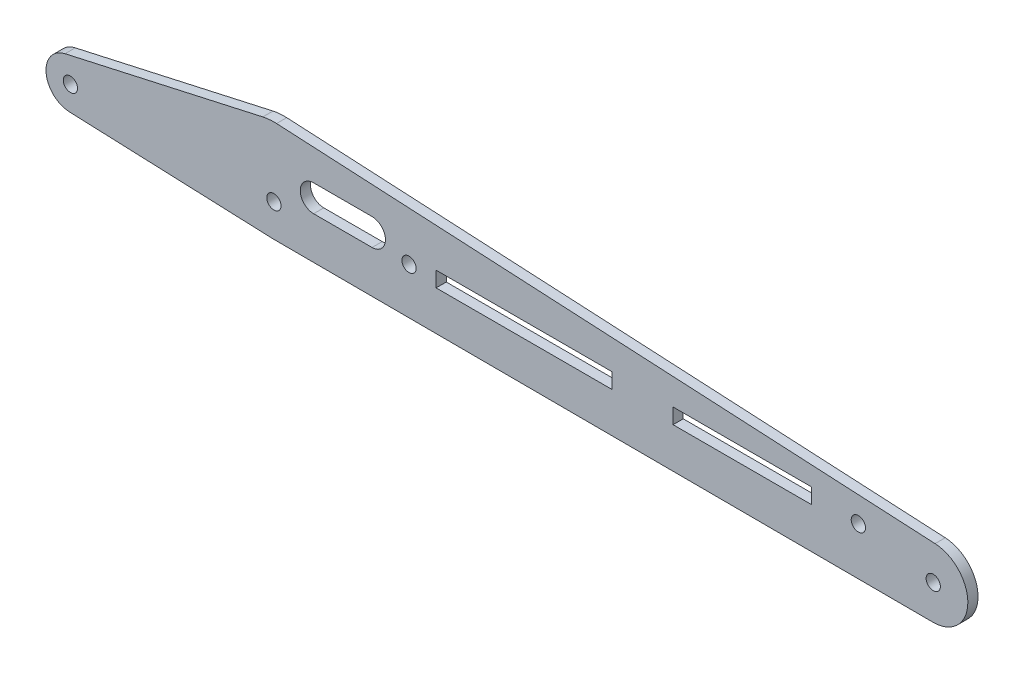
ISO-10303-21;
HEADER;
FILE_DESCRIPTION(('STEP AP214'),'2;1');
FILE_NAME('part.step','',(''),(''),'','','');
FILE_SCHEMA(('AUTOMOTIVE_DESIGN { 1 0 10303 214 1 1 1 1 }'));
ENDSEC;
DATA;
#1=APPLICATION_CONTEXT('core data for automotive mechanical design processes');
#2=APPLICATION_PROTOCOL_DEFINITION('international standard','automotive_design',2000,#1);
#3=PRODUCT_CONTEXT('',#1,'mechanical');
#4=PRODUCT('Part','Part','',(#3));
#5=PRODUCT_RELATED_PRODUCT_CATEGORY('part','',(#4));
#6=PRODUCT_DEFINITION_FORMATION('','',#4);
#7=PRODUCT_DEFINITION_CONTEXT('part definition',#1,'design');
#8=PRODUCT_DEFINITION('design','',#6,#7);
#9=PRODUCT_DEFINITION_SHAPE('','',#8);
#10=(LENGTH_UNIT() NAMED_UNIT(*) SI_UNIT(.MILLI.,.METRE.));
#11=(NAMED_UNIT(*) PLANE_ANGLE_UNIT() SI_UNIT($,.RADIAN.));
#12=(NAMED_UNIT(*) SI_UNIT($,.STERADIAN.) SOLID_ANGLE_UNIT());
#13=UNCERTAINTY_MEASURE_WITH_UNIT(LENGTH_MEASURE(1.E-05),#10,'distance_accuracy_value','');
#14=(GEOMETRIC_REPRESENTATION_CONTEXT(3) GLOBAL_UNCERTAINTY_ASSIGNED_CONTEXT((#13)) GLOBAL_UNIT_ASSIGNED_CONTEXT((#10,
#11,#12)) REPRESENTATION_CONTEXT('',''));
#15=CARTESIAN_POINT('',(0.,0.,0.));
#16=DIRECTION('',(0.,0.,1.));
#17=DIRECTION('',(1.,0.,0.));
#18=AXIS2_PLACEMENT_3D('',#15,#16,#17);
#19=CARTESIAN_POINT('',(1.0284513855781,19.5883770496251,2.5));
#20=DIRECTION('',(0.052430928939079,0.998624552917955,0.));
#21=DIRECTION('',(-0.998624552917955,0.052430928939079,0.));
#22=AXIS2_PLACEMENT_3D('',#19,#20,#21);
#23=PLANE('',#22);
#24=DIRECTION('',(0.998624552917955,-0.052430928939079,0.));
#25=VECTOR('',#24,1.);
#26=CARTESIAN_POINT('',(1.0284513855781,19.5883770496251,0.));
#27=LINE('',#26,#25);
#28=CARTESIAN_POINT('',(50.6553866117385,16.9828069114744,0.));
#29=VERTEX_POINT('',#28);
#30=CARTESIAN_POINT('',(212.445662895982,8.48830869980262,0.));
#31=VERTEX_POINT('',#30);
#32=EDGE_CURVE('E381',#29,#31,#27,.T.);
#33=ORIENTED_EDGE('',*,*,#32,.F.);
#34=DIRECTION('',(0.,0.,-1.));
#35=VECTOR('',#34,1.);
#36=CARTESIAN_POINT('',(50.6553866117385,16.9828069114744,2.5));
#37=LINE('',#36,#35);
#38=CARTESIAN_POINT('',(50.6553866117385,16.9828069114744,2.5));
#39=VERTEX_POINT('',#38);
#40=EDGE_CURVE('E12',#39,#29,#37,.T.);
#41=ORIENTED_EDGE('',*,*,#40,.F.);
#42=DIRECTION('',(0.998624552917955,-0.052430928939079,0.));
#43=VECTOR('',#42,1.);
#44=CARTESIAN_POINT('',(1.0284513855781,19.5883770496251,2.5));
#45=LINE('',#44,#43);
#46=CARTESIAN_POINT('',(212.445662895982,8.48830869980262,2.5));
#47=VERTEX_POINT('',#46);
#48=EDGE_CURVE('E339',#39,#47,#45,.T.);
#49=ORIENTED_EDGE('',*,*,#48,.T.);
#50=DIRECTION('',(0.,0.,-1.));
#51=VECTOR('',#50,1.);
#52=CARTESIAN_POINT('',(212.445662895982,8.48830869980262,2.5));
#53=LINE('',#52,#51);
#54=EDGE_CURVE('E369',#47,#31,#53,.T.);
#55=ORIENTED_EDGE('',*,*,#54,.T.);
#56=EDGE_LOOP('',(#33,#41,#49,#55));
#57=FACE_BOUND('',#56,.T.);
#58=ADVANCED_FACE('F47',(#57),#23,.T.);
#59=CARTESIAN_POINT('',(50.,4.5,2.5));
#60=DIRECTION('',(0.,0.,-1.));
#61=DIRECTION('',(-1.,0.,0.));
#62=AXIS2_PLACEMENT_3D('',#59,#60,#61);
#63=CYLINDRICAL_SURFACE('',#62,12.5);
#64=CARTESIAN_POINT('',(50.,4.5,0.));
#65=DIRECTION('',(0.,0.,1.));
#66=DIRECTION('',(1.,0.,0.));
#67=AXIS2_PLACEMENT_3D('',#64,#65,#66);
#68=CIRCLE('',#67,12.5);
#69=CARTESIAN_POINT('',(47.2770170996738,16.6998100036243,0.));
#70=VERTEX_POINT('',#69);
#71=EDGE_CURVE('E385',#29,#70,#68,.T.);
#72=ORIENTED_EDGE('',*,*,#71,.T.);
#73=DIRECTION('',(0.,0.,-1.));
#74=VECTOR('',#73,1.);
#75=CARTESIAN_POINT('',(47.2770170996738,16.6998100036243,2.5));
#76=LINE('',#75,#74);
#77=CARTESIAN_POINT('',(47.2770170996738,16.6998100036243,2.5));
#78=VERTEX_POINT('',#77);
#79=EDGE_CURVE('E56',#78,#70,#76,.T.);
#80=ORIENTED_EDGE('',*,*,#79,.F.);
#81=CARTESIAN_POINT('',(50.,4.5,2.5));
#82=DIRECTION('',(0.,0.,1.));
#83=DIRECTION('',(1.,0.,0.));
#84=AXIS2_PLACEMENT_3D('',#81,#82,#83);
#85=CIRCLE('',#84,12.5);
#86=EDGE_CURVE('E343',#39,#78,#85,.T.);
#87=ORIENTED_EDGE('',*,*,#86,.F.);
#88=ORIENTED_EDGE('',*,*,#40,.T.);
#89=EDGE_LOOP('',(#72,#80,#87,#88));
#90=FACE_BOUND('',#89,.T.);
#91=ADVANCED_FACE('F440',(#90),#63,.T.);
#92=CARTESIAN_POINT('',(-1.30703179215657,5.85590880173966,2.5));
#93=DIRECTION('',(0.217838632026095,-0.975984800289943,0.));
#94=DIRECTION('',(0.975984800289943,0.217838632026095,0.));
#95=AXIS2_PLACEMENT_3D('',#92,#93,#94);
#96=PLANE('',#95);
#97=DIRECTION('',(-0.975984800289943,-0.217838632026095,0.));
#98=VECTOR('',#97,1.);
#99=CARTESIAN_POINT('',(-1.30703179215657,5.85590880173966,0.));
#100=LINE('',#99,#98);
#101=CARTESIAN_POINT('',(-1.30703179215657,5.85590880173966,0.));
#102=VERTEX_POINT('',#101);
#103=EDGE_CURVE('E389',#70,#102,#100,.T.);
#104=ORIENTED_EDGE('',*,*,#103,.T.);
#105=DIRECTION('',(0.,0.,-1.));
#106=VECTOR('',#105,1.);
#107=CARTESIAN_POINT('',(-1.30703179215657,5.85590880173966,2.5));
#108=LINE('',#107,#106);
#109=CARTESIAN_POINT('',(-1.30703179215657,5.85590880173966,2.5));
#110=VERTEX_POINT('',#109);
#111=EDGE_CURVE('E428',#110,#102,#108,.T.);
#112=ORIENTED_EDGE('',*,*,#111,.F.);
#113=DIRECTION('',(-0.975984800289943,-0.217838632026095,0.));
#114=VECTOR('',#113,1.);
#115=CARTESIAN_POINT('',(-1.30703179215657,5.85590880173966,2.5));
#116=LINE('',#115,#114);
#117=EDGE_CURVE('E347',#78,#110,#116,.T.);
#118=ORIENTED_EDGE('',*,*,#117,.F.);
#119=ORIENTED_EDGE('',*,*,#79,.T.);
#120=EDGE_LOOP('',(#104,#112,#118,#119));
#121=FACE_BOUND('',#120,.T.);
#122=ADVANCED_FACE('F435',(#121),#96,.F.);
#123=CARTESIAN_POINT('',(0.,0.,2.5));
#124=DIRECTION('',(0.,0.,-1.));
#125=DIRECTION('',(-1.,0.,0.));
#126=AXIS2_PLACEMENT_3D('',#123,#124,#125);
#127=CYLINDRICAL_SURFACE('',#126,6.);
#128=CARTESIAN_POINT('',(0.,0.,0.));
#129=DIRECTION('',(0.,0.,1.));
#130=DIRECTION('',(1.,0.,0.));
#131=AXIS2_PLACEMENT_3D('',#128,#129,#130);
#132=CIRCLE('',#131,6.);
#133=CARTESIAN_POINT('',(-0.240433737056803,-5.99518069936886,0.));
#134=VERTEX_POINT('',#133);
#135=EDGE_CURVE('E393',#102,#134,#132,.T.);
#136=ORIENTED_EDGE('',*,*,#135,.T.);
#137=DIRECTION('',(0.,0.,-1.));
#138=VECTOR('',#137,1.);
#139=CARTESIAN_POINT('',(-0.240433737056803,-5.99518069936886,2.5));
#140=LINE('',#139,#138);
#141=CARTESIAN_POINT('',(-0.240433737056803,-5.99518069936886,2.5));
#142=VERTEX_POINT('',#141);
#143=EDGE_CURVE('E424',#142,#134,#140,.T.);
#144=ORIENTED_EDGE('',*,*,#143,.F.);
#145=CARTESIAN_POINT('',(0.,0.,2.5));
#146=DIRECTION('',(0.,0.,1.));
#147=DIRECTION('',(1.,0.,0.));
#148=AXIS2_PLACEMENT_3D('',#145,#146,#147);
#149=CIRCLE('',#148,6.);
#150=EDGE_CURVE('E351',#110,#142,#149,.T.);
#151=ORIENTED_EDGE('',*,*,#150,.F.);
#152=ORIENTED_EDGE('',*,*,#111,.T.);
#153=EDGE_LOOP('',(#136,#144,#151,#152));
#154=FACE_BOUND('',#153,.T.);
#155=ADVANCED_FACE('F462',(#154),#127,.T.);
#156=CARTESIAN_POINT('',(-0.240433737056803,-5.99518069936886,2.5));
#157=DIRECTION('',(0.0400722895094671,0.999196783228143,0.));
#158=DIRECTION('',(-0.999196783228143,0.0400722895094671,0.));
#159=AXIS2_PLACEMENT_3D('',#156,#157,#158);
#160=PLANE('',#159);
#161=DIRECTION('',(0.999196783228144,-0.0400722895094671,0.));
#162=VECTOR('',#161,1.);
#163=CARTESIAN_POINT('',(-0.240433737056803,-5.99518069936886,0.));
#164=LINE('',#163,#162);
#165=CARTESIAN_POINT('',(49.4990963811317,-7.9899597903518,0.));
#166=VERTEX_POINT('',#165);
#167=EDGE_CURVE('E397',#134,#166,#164,.T.);
#168=ORIENTED_EDGE('',*,*,#167,.T.);
#169=DIRECTION('',(0.,0.,-1.));
#170=VECTOR('',#169,1.);
#171=CARTESIAN_POINT('',(49.4990963811317,-7.9899597903518,2.5));
#172=LINE('',#171,#170);
#173=CARTESIAN_POINT('',(49.4990963811317,-7.9899597903518,2.5));
#174=VERTEX_POINT('',#173);
#175=EDGE_CURVE('E420',#174,#166,#172,.T.);
#176=ORIENTED_EDGE('',*,*,#175,.F.);
#177=DIRECTION('',(0.999196783228144,-0.0400722895094671,0.));
#178=VECTOR('',#177,1.);
#179=CARTESIAN_POINT('',(-0.240433737056803,-5.99518069936886,2.5));
#180=LINE('',#179,#178);
#181=EDGE_CURVE('E355',#142,#174,#180,.T.);
#182=ORIENTED_EDGE('',*,*,#181,.F.);
#183=ORIENTED_EDGE('',*,*,#143,.T.);
#184=EDGE_LOOP('',(#168,#176,#182,#183));
#185=FACE_BOUND('',#184,.T.);
#186=ADVANCED_FACE('F460',(#185),#160,.F.);
#187=CARTESIAN_POINT('',(50.,4.5,2.5));
#188=DIRECTION('',(0.,0.,-1.));
#189=DIRECTION('',(-1.,0.,0.));
#190=AXIS2_PLACEMENT_3D('',#187,#188,#189);
#191=CYLINDRICAL_SURFACE('',#190,12.5);
#192=CARTESIAN_POINT('',(50.,4.5,0.));
#193=DIRECTION('',(0.,0.,1.));
#194=DIRECTION('',(1.,0.,0.));
#195=AXIS2_PLACEMENT_3D('',#192,#193,#194);
#196=CIRCLE('',#195,12.5);
#197=CARTESIAN_POINT('',(49.9614214067658,-7.999940467544,0.));
#198=VERTEX_POINT('',#197);
#199=EDGE_CURVE('E401',#166,#198,#196,.T.);
#200=ORIENTED_EDGE('',*,*,#199,.T.);
#201=DIRECTION('',(0.,0.,-1.));
#202=VECTOR('',#201,1.);
#203=CARTESIAN_POINT('',(49.9614214067658,-7.999940467544,2.5));
#204=LINE('',#203,#202);
#205=CARTESIAN_POINT('',(49.9614214067658,-7.999940467544,2.5));
#206=VERTEX_POINT('',#205);
#207=EDGE_CURVE('E417',#206,#198,#204,.T.);
#208=ORIENTED_EDGE('',*,*,#207,.F.);
#209=CARTESIAN_POINT('',(50.,4.5,2.5));
#210=DIRECTION('',(0.,0.,1.));
#211=DIRECTION('',(1.,0.,0.));
#212=AXIS2_PLACEMENT_3D('',#209,#210,#211);
#213=CIRCLE('',#212,12.5);
#214=EDGE_CURVE('E359',#174,#206,#213,.T.);
#215=ORIENTED_EDGE('',*,*,#214,.F.);
#216=ORIENTED_EDGE('',*,*,#175,.T.);
#217=EDGE_LOOP('',(#200,#208,#215,#216));
#218=FACE_BOUND('',#217,.T.);
#219=ADVANCED_FACE('F456',(#218),#191,.T.);
#220=CARTESIAN_POINT('',(-0.0242141073003574,-7.84566969281035,2.5));
#221=DIRECTION('',(-0.00308628745873976,-0.99999523740352,0.));
#222=DIRECTION('',(0.99999523740352,-0.00308628745873976,0.));
#223=AXIS2_PLACEMENT_3D('',#220,#221,#222);
#224=PLANE('',#223);
#225=DIRECTION('',(-0.99999523740352,0.00308628745873976,0.));
#226=VECTOR('',#225,1.);
#227=CARTESIAN_POINT('',(-0.0242141073003574,-7.84566969281035,0.));
#228=LINE('',#227,#226);
#229=CARTESIAN_POINT('',(211.973766556601,-8.49995951792992,0.));
#230=VERTEX_POINT('',#229);
#231=EDGE_CURVE('E405',#230,#198,#228,.T.);
#232=ORIENTED_EDGE('',*,*,#231,.F.);
#233=DIRECTION('',(0.,0.,-1.));
#234=VECTOR('',#233,1.);
#235=CARTESIAN_POINT('',(211.973766556601,-8.49995951792992,2.5));
#236=LINE('',#235,#234);
#237=CARTESIAN_POINT('',(211.973766556601,-8.49995951792992,2.5));
#238=VERTEX_POINT('',#237);
#239=EDGE_CURVE('E414',#238,#230,#236,.T.);
#240=ORIENTED_EDGE('',*,*,#239,.F.);
#241=DIRECTION('',(-0.99999523740352,0.00308628745873976,0.));
#242=VECTOR('',#241,1.);
#243=CARTESIAN_POINT('',(-0.0242141073003574,-7.84566969281035,2.5));
#244=LINE('',#243,#242);
#245=EDGE_CURVE('E362',#238,#206,#244,.T.);
#246=ORIENTED_EDGE('',*,*,#245,.T.);
#247=ORIENTED_EDGE('',*,*,#207,.T.);
#248=EDGE_LOOP('',(#232,#240,#246,#247));
#249=FACE_BOUND('',#248,.T.);
#250=ADVANCED_FACE('F452',(#249),#224,.T.);
#251=CARTESIAN_POINT('',(212.,0.,2.5));
#252=DIRECTION('',(0.,0.,-1.));
#253=DIRECTION('',(-1.,0.,0.));
#254=AXIS2_PLACEMENT_3D('',#251,#252,#253);
#255=CYLINDRICAL_SURFACE('',#254,1.75000000000001);
#256=CARTESIAN_POINT('',(212.,0.,2.5));
#257=DIRECTION('',(0.,0.,1.));
#258=DIRECTION('',(1.,0.,0.));
#259=AXIS2_PLACEMENT_3D('',#256,#257,#258);
#260=CIRCLE('',#259,1.75000000000001);
#261=CARTESIAN_POINT('',(213.75,0.,2.5));
#262=VERTEX_POINT('',#261);
#263=EDGE_CURVE('E335',#262,#262,#260,.T.);
#264=ORIENTED_EDGE('',*,*,#263,.T.);
#265=EDGE_LOOP('',(#264));
#266=FACE_BOUND('',#265,.T.);
#267=CARTESIAN_POINT('',(212.,0.,0.));
#268=DIRECTION('',(0.,0.,1.));
#269=DIRECTION('',(1.,0.,0.));
#270=AXIS2_PLACEMENT_3D('',#267,#268,#269);
#271=CIRCLE('',#270,1.75000000000001);
#272=CARTESIAN_POINT('',(213.75,0.,0.));
#273=VERTEX_POINT('',#272);
#274=EDGE_CURVE('E377',#273,#273,#271,.T.);
#275=ORIENTED_EDGE('',*,*,#274,.F.);
#276=EDGE_LOOP('',(#275));
#277=FACE_BOUND('',#276,.T.);
#278=ADVANCED_FACE('F488',(#266,#277),#255,.F.);
#279=CARTESIAN_POINT('',(50.,0.,2.5));
#280=DIRECTION('',(0.,0.,-1.));
#281=DIRECTION('',(-1.,0.,0.));
#282=AXIS2_PLACEMENT_3D('',#279,#280,#281);
#283=CYLINDRICAL_SURFACE('',#282,1.75);
#284=CARTESIAN_POINT('',(50.,0.,2.5));
#285=DIRECTION('',(0.,0.,1.));
#286=DIRECTION('',(1.,0.,0.));
#287=AXIS2_PLACEMENT_3D('',#284,#285,#286);
#288=CIRCLE('',#287,1.75);
#289=CARTESIAN_POINT('',(51.75,0.,2.5));
#290=VERTEX_POINT('',#289);
#291=EDGE_CURVE('E330',#290,#290,#288,.T.);
#292=ORIENTED_EDGE('',*,*,#291,.T.);
#293=EDGE_LOOP('',(#292));
#294=FACE_BOUND('',#293,.T.);
#295=CARTESIAN_POINT('',(50.,0.,0.));
#296=DIRECTION('',(0.,0.,1.));
#297=DIRECTION('',(1.,0.,0.));
#298=AXIS2_PLACEMENT_3D('',#295,#296,#297);
#299=CIRCLE('',#298,1.75);
#300=CARTESIAN_POINT('',(51.75,0.,0.));
#301=VERTEX_POINT('',#300);
#302=EDGE_CURVE('E373',#301,#301,#299,.T.);
#303=ORIENTED_EDGE('',*,*,#302,.F.);
#304=EDGE_LOOP('',(#303));
#305=FACE_BOUND('',#304,.T.);
#306=ADVANCED_FACE('F490',(#294,#305),#283,.F.);
#307=CARTESIAN_POINT('',(0.,0.,2.5));
#308=DIRECTION('',(0.,0.,-1.));
#309=DIRECTION('',(-1.,0.,0.));
#310=AXIS2_PLACEMENT_3D('',#307,#308,#309);
#311=CYLINDRICAL_SURFACE('',#310,1.75);
#312=CARTESIAN_POINT('',(0.,0.,2.5));
#313=DIRECTION('',(0.,0.,1.));
#314=DIRECTION('',(1.,0.,0.));
#315=AXIS2_PLACEMENT_3D('',#312,#313,#314);
#316=CIRCLE('',#315,1.75);
#317=CARTESIAN_POINT('',(1.75,0.,2.5));
#318=VERTEX_POINT('',#317);
#319=EDGE_CURVE('E326',#318,#318,#316,.T.);
#320=ORIENTED_EDGE('',*,*,#319,.T.);
#321=EDGE_LOOP('',(#320));
#322=FACE_BOUND('',#321,.T.);
#323=CARTESIAN_POINT('',(0.,0.,0.));
#324=DIRECTION('',(0.,0.,1.));
#325=DIRECTION('',(1.,0.,0.));
#326=AXIS2_PLACEMENT_3D('',#323,#324,#325);
#327=CIRCLE('',#326,1.75);
#328=CARTESIAN_POINT('',(1.75,0.,0.));
#329=VERTEX_POINT('',#328);
#330=EDGE_CURVE('E234',#329,#329,#327,.T.);
#331=ORIENTED_EDGE('',*,*,#330,.F.);
#332=EDGE_LOOP('',(#331));
#333=FACE_BOUND('',#332,.T.);
#334=ADVANCED_FACE('F49',(#322,#333),#311,.F.);
#335=CARTESIAN_POINT('',(212.,0.,2.5));
#336=DIRECTION('',(0.,0.,-1.));
#337=DIRECTION('',(-1.,0.,0.));
#338=AXIS2_PLACEMENT_3D('',#335,#336,#337);
#339=CYLINDRICAL_SURFACE('',#338,8.5);
#340=CARTESIAN_POINT('',(212.,0.,0.));
#341=DIRECTION('',(0.,0.,1.));
#342=DIRECTION('',(1.,0.,0.));
#343=AXIS2_PLACEMENT_3D('',#340,#341,#342);
#344=CIRCLE('',#343,8.5);
#345=EDGE_CURVE('E331',#230,#31,#344,.T.);
#346=ORIENTED_EDGE('',*,*,#345,.T.);
#347=ORIENTED_EDGE('',*,*,#54,.F.);
#348=CARTESIAN_POINT('',(212.,0.,2.5));
#349=DIRECTION('',(0.,0.,1.));
#350=DIRECTION('',(1.,0.,0.));
#351=AXIS2_PLACEMENT_3D('',#348,#349,#350);
#352=CIRCLE('',#351,8.5);
#353=EDGE_CURVE('E366',#238,#47,#352,.T.);
#354=ORIENTED_EDGE('',*,*,#353,.F.);
#355=ORIENTED_EDGE('',*,*,#239,.T.);
#356=EDGE_LOOP('',(#346,#347,#354,#355));
#357=FACE_BOUND('',#356,.T.);
#358=ADVANCED_FACE('F449',(#357),#339,.T.);
#359=CARTESIAN_POINT('',(0.,0.,2.5));
#360=DIRECTION('',(0.,0.,1.));
#361=DIRECTION('',(1.,0.,0.));
#362=AXIS2_PLACEMENT_3D('',#359,#360,#361);
#363=PLANE('',#362);
#364=CARTESIAN_POINT('',(193.595777353465,3.28702322475749,2.5));
#365=DIRECTION('',(0.,0.,1.));
#366=DIRECTION('',(1.,0.,0.));
#367=AXIS2_PLACEMENT_3D('',#364,#365,#366);
#368=CIRCLE('',#367,1.75000000000001);
#369=CARTESIAN_POINT('',(195.345777353465,3.28702322475749,2.5));
#370=VERTEX_POINT('',#369);
#371=EDGE_CURVE('E670',#370,#370,#368,.T.);
#372=ORIENTED_EDGE('',*,*,#371,.F.);
#373=EDGE_LOOP('',(#372));
#374=FACE_BOUND('',#373,.T.);
#375=CARTESIAN_POINT('',(83.1882766397634,3.28702322475749,2.5));
#376=DIRECTION('',(0.,0.,1.));
#377=DIRECTION('',(1.,0.,0.));
#378=AXIS2_PLACEMENT_3D('',#375,#376,#377);
#379=CIRCLE('',#378,1.75);
#380=CARTESIAN_POINT('',(84.9382766397634,3.28702322475749,2.5));
#381=VERTEX_POINT('',#380);
#382=EDGE_CURVE('E672',#381,#381,#379,.T.);
#383=ORIENTED_EDGE('',*,*,#382,.F.);
#384=EDGE_LOOP('',(#383));
#385=FACE_BOUND('',#384,.T.);
#386=CARTESIAN_POINT('',(59.7582362209733,5.62656902603168,2.5));
#387=DIRECTION('',(0.,0.,1.));
#388=DIRECTION('',(1.,0.,0.));
#389=AXIS2_PLACEMENT_3D('',#386,#387,#388);
#390=CIRCLE('',#389,3.28795015374843);
#391=CARTESIAN_POINT('',(59.7582362209733,8.91451917978011,2.5));
#392=VERTEX_POINT('',#391);
#393=CARTESIAN_POINT('',(59.7582362209733,2.33861887228325,2.5));
#394=VERTEX_POINT('',#393);
#395=EDGE_CURVE('E63',#392,#394,#390,.T.);
#396=ORIENTED_EDGE('',*,*,#395,.F.);
#397=DIRECTION('',(-1.,0.,0.));
#398=VECTOR('',#397,1.);
#399=CARTESIAN_POINT('',(59.7582362209733,8.91451917978011,2.5));
#400=LINE('',#399,#398);
#401=CARTESIAN_POINT('',(74.1156185590081,8.91451917978011,2.5));
#402=VERTEX_POINT('',#401);
#403=EDGE_CURVE('E208',#402,#392,#400,.T.);
#404=ORIENTED_EDGE('',*,*,#403,.F.);
#405=CARTESIAN_POINT('',(74.1156185590081,5.62656902603168,2.5));
#406=DIRECTION('',(0.,0.,1.));
#407=DIRECTION('',(1.,0.,0.));
#408=AXIS2_PLACEMENT_3D('',#405,#406,#407);
#409=CIRCLE('',#408,3.28795015374843);
#410=CARTESIAN_POINT('',(74.1156185590081,2.33861887228325,2.5));
#411=VERTEX_POINT('',#410);
#412=EDGE_CURVE('E212',#411,#402,#409,.T.);
#413=ORIENTED_EDGE('',*,*,#412,.F.);
#414=DIRECTION('',(1.,0.,0.));
#415=VECTOR('',#414,1.);
#416=CARTESIAN_POINT('',(59.7582362209733,2.33861887228325,2.5));
#417=LINE('',#416,#415);
#418=EDGE_CURVE('E224',#394,#411,#417,.T.);
#419=ORIENTED_EDGE('',*,*,#418,.F.);
#420=EDGE_LOOP('',(#396,#404,#413,#419));
#421=FACE_BOUND('',#420,.T.);
#422=DIRECTION('',(0.,1.,0.));
#423=VECTOR('',#422,1.);
#424=CARTESIAN_POINT('',(133.027762357516,1.60489189527374,2.5));
#425=LINE('',#424,#423);
#426=CARTESIAN_POINT('',(133.027762357516,1.60489189527374,2.5));
#427=VERTEX_POINT('',#426);
#428=CARTESIAN_POINT('',(133.027762357516,5.37553065837328,2.5));
#429=VERTEX_POINT('',#428);
#430=EDGE_CURVE('E71',#427,#429,#425,.T.);
#431=ORIENTED_EDGE('',*,*,#430,.F.);
#432=DIRECTION('',(1.,0.,0.));
#433=VECTOR('',#432,1.);
#434=CARTESIAN_POINT('',(89.8528256396395,1.60489189527374,2.5));
#435=LINE('',#434,#433);
#436=CARTESIAN_POINT('',(89.8528256396395,1.60489189527374,2.5));
#437=VERTEX_POINT('',#436);
#438=EDGE_CURVE('E245',#437,#427,#435,.T.);
#439=ORIENTED_EDGE('',*,*,#438,.F.);
#440=DIRECTION('',(0.,-1.,0.));
#441=VECTOR('',#440,1.);
#442=CARTESIAN_POINT('',(89.8528256396395,1.60489189527374,2.5));
#443=LINE('',#442,#441);
#444=CARTESIAN_POINT('',(89.8528256396395,5.37553065837328,2.5));
#445=VERTEX_POINT('',#444);
#446=EDGE_CURVE('E265',#445,#437,#443,.T.);
#447=ORIENTED_EDGE('',*,*,#446,.F.);
#448=DIRECTION('',(-1.,0.,0.));
#449=VECTOR('',#448,1.);
#450=CARTESIAN_POINT('',(89.8528256396395,5.37553065837328,2.5));
#451=LINE('',#450,#449);
#452=EDGE_CURVE('E260',#429,#445,#451,.T.);
#453=ORIENTED_EDGE('',*,*,#452,.F.);
#454=EDGE_LOOP('',(#431,#439,#447,#453));
#455=FACE_BOUND('',#454,.T.);
#456=DIRECTION('',(0.,1.,0.));
#457=VECTOR('',#456,1.);
#458=CARTESIAN_POINT('',(182.086500773043,1.60489189527374,2.5));
#459=LINE('',#458,#457);
#460=CARTESIAN_POINT('',(182.086500773043,1.60489189527374,2.5));
#461=VERTEX_POINT('',#460);
#462=CARTESIAN_POINT('',(182.086500773043,5.37553065837328,2.5));
#463=VERTEX_POINT('',#462);
#464=EDGE_CURVE('E300',#461,#463,#459,.T.);
#465=ORIENTED_EDGE('',*,*,#464,.F.);
#466=DIRECTION('',(1.,0.,0.));
#467=VECTOR('',#466,1.);
#468=CARTESIAN_POINT('',(148.071936645753,1.60489189527374,2.5));
#469=LINE('',#468,#467);
#470=CARTESIAN_POINT('',(148.071936645753,1.60489189527374,2.5));
#471=VERTEX_POINT('',#470);
#472=EDGE_CURVE('E287',#471,#461,#469,.T.);
#473=ORIENTED_EDGE('',*,*,#472,.F.);
#474=DIRECTION('',(0.,-1.,0.));
#475=VECTOR('',#474,1.);
#476=CARTESIAN_POINT('',(148.071936645753,1.60489189527374,2.5));
#477=LINE('',#476,#475);
#478=CARTESIAN_POINT('',(148.071936645753,5.37553065837328,2.5));
#479=VERTEX_POINT('',#478);
#480=EDGE_CURVE('E308',#479,#471,#477,.T.);
#481=ORIENTED_EDGE('',*,*,#480,.F.);
#482=DIRECTION('',(-1.,0.,0.));
#483=VECTOR('',#482,1.);
#484=CARTESIAN_POINT('',(148.071936645753,5.37553065837328,2.5));
#485=LINE('',#484,#483);
#486=EDGE_CURVE('E303',#463,#479,#485,.T.);
#487=ORIENTED_EDGE('',*,*,#486,.F.);
#488=EDGE_LOOP('',(#465,#473,#481,#487));
#489=FACE_BOUND('',#488,.T.);
#490=ORIENTED_EDGE('',*,*,#319,.F.);
#491=EDGE_LOOP('',(#490));
#492=FACE_BOUND('',#491,.T.);
#493=ORIENTED_EDGE('',*,*,#291,.F.);
#494=EDGE_LOOP('',(#493));
#495=FACE_BOUND('',#494,.T.);
#496=ORIENTED_EDGE('',*,*,#263,.F.);
#497=EDGE_LOOP('',(#496));
#498=FACE_BOUND('',#497,.T.);
#499=ORIENTED_EDGE('',*,*,#48,.F.);
#500=ORIENTED_EDGE('',*,*,#86,.T.);
#501=ORIENTED_EDGE('',*,*,#117,.T.);
#502=ORIENTED_EDGE('',*,*,#150,.T.);
#503=ORIENTED_EDGE('',*,*,#181,.T.);
#504=ORIENTED_EDGE('',*,*,#214,.T.);
#505=ORIENTED_EDGE('',*,*,#245,.F.);
#506=ORIENTED_EDGE('',*,*,#353,.T.);
#507=EDGE_LOOP('',(#499,#500,#501,#502,#503,#504,#505,#506));
#508=FACE_BOUND('',#507,.T.);
#509=ADVANCED_FACE('F464',(#374,#385,#421,#455,#489,#492,#495,#498,#508),#363,.T.);
#510=CARTESIAN_POINT('',(0.,0.,0.));
#511=DIRECTION('',(0.,0.,1.));
#512=DIRECTION('',(1.,0.,0.));
#513=AXIS2_PLACEMENT_3D('',#510,#511,#512);
#514=PLANE('',#513);
#515=CARTESIAN_POINT('',(193.595777353465,3.28702322475749,0.));
#516=DIRECTION('',(0.,0.,1.));
#517=DIRECTION('',(1.,0.,0.));
#518=AXIS2_PLACEMENT_3D('',#515,#516,#517);
#519=CIRCLE('',#518,1.75000000000001);
#520=CARTESIAN_POINT('',(195.345777353465,3.28702322475749,0.));
#521=VERTEX_POINT('',#520);
#522=EDGE_CURVE('E304',#521,#521,#519,.T.);
#523=ORIENTED_EDGE('',*,*,#522,.T.);
#524=EDGE_LOOP('',(#523));
#525=FACE_BOUND('',#524,.T.);
#526=CARTESIAN_POINT('',(83.1882766397634,3.28702322475749,0.));
#527=DIRECTION('',(0.,0.,1.));
#528=DIRECTION('',(1.,0.,0.));
#529=AXIS2_PLACEMENT_3D('',#526,#527,#528);
#530=CIRCLE('',#529,1.75);
#531=CARTESIAN_POINT('',(84.9382766397634,3.28702322475749,0.));
#532=VERTEX_POINT('',#531);
#533=EDGE_CURVE('E215',#532,#532,#530,.T.);
#534=ORIENTED_EDGE('',*,*,#533,.T.);
#535=EDGE_LOOP('',(#534));
#536=FACE_BOUND('',#535,.T.);
#537=DIRECTION('',(-1.,0.,0.));
#538=VECTOR('',#537,1.);
#539=CARTESIAN_POINT('',(59.7582362209733,8.91451917978011,0.));
#540=LINE('',#539,#538);
#541=CARTESIAN_POINT('',(74.1156185590081,8.91451917978011,0.));
#542=VERTEX_POINT('',#541);
#543=CARTESIAN_POINT('',(59.7582362209733,8.91451917978011,0.));
#544=VERTEX_POINT('',#543);
#545=EDGE_CURVE('E193',#542,#544,#540,.T.);
#546=ORIENTED_EDGE('',*,*,#545,.T.);
#547=CARTESIAN_POINT('',(59.7582362209733,5.62656902603168,0.));
#548=DIRECTION('',(0.,0.,1.));
#549=DIRECTION('',(1.,0.,0.));
#550=AXIS2_PLACEMENT_3D('',#547,#548,#549);
#551=CIRCLE('',#550,3.28795015374843);
#552=CARTESIAN_POINT('',(59.7582362209733,2.33861887228325,0.));
#553=VERTEX_POINT('',#552);
#554=EDGE_CURVE('E186',#544,#553,#551,.T.);
#555=ORIENTED_EDGE('',*,*,#554,.T.);
#556=DIRECTION('',(1.,0.,0.));
#557=VECTOR('',#556,1.);
#558=CARTESIAN_POINT('',(59.7582362209733,2.33861887228325,0.));
#559=LINE('',#558,#557);
#560=CARTESIAN_POINT('',(74.1156185590081,2.33861887228325,0.));
#561=VERTEX_POINT('',#560);
#562=EDGE_CURVE('E197',#553,#561,#559,.T.);
#563=ORIENTED_EDGE('',*,*,#562,.T.);
#564=CARTESIAN_POINT('',(74.1156185590081,5.62656902603168,0.));
#565=DIRECTION('',(0.,0.,1.));
#566=DIRECTION('',(1.,0.,0.));
#567=AXIS2_PLACEMENT_3D('',#564,#565,#566);
#568=CIRCLE('',#567,3.28795015374843);
#569=EDGE_CURVE('E202',#561,#542,#568,.T.);
#570=ORIENTED_EDGE('',*,*,#569,.T.);
#571=EDGE_LOOP('',(#546,#555,#563,#570));
#572=FACE_BOUND('',#571,.T.);
#573=DIRECTION('',(1.,0.,0.));
#574=VECTOR('',#573,1.);
#575=CARTESIAN_POINT('',(89.8528256396395,1.60489189527374,0.));
#576=LINE('',#575,#574);
#577=CARTESIAN_POINT('',(89.8528256396395,1.60489189527374,0.));
#578=VERTEX_POINT('',#577);
#579=CARTESIAN_POINT('',(133.027762357516,1.60489189527374,0.));
#580=VERTEX_POINT('',#579);
#581=EDGE_CURVE('E253',#578,#580,#576,.T.);
#582=ORIENTED_EDGE('',*,*,#581,.T.);
#583=DIRECTION('',(0.,1.,0.));
#584=VECTOR('',#583,1.);
#585=CARTESIAN_POINT('',(133.027762357516,1.60489189527374,0.));
#586=LINE('',#585,#584);
#587=CARTESIAN_POINT('',(133.027762357516,5.37553065837328,0.));
#588=VERTEX_POINT('',#587);
#589=EDGE_CURVE('E240',#580,#588,#586,.T.);
#590=ORIENTED_EDGE('',*,*,#589,.T.);
#591=DIRECTION('',(-1.,0.,0.));
#592=VECTOR('',#591,1.);
#593=CARTESIAN_POINT('',(89.8528256396395,5.37553065837328,0.));
#594=LINE('',#593,#592);
#595=CARTESIAN_POINT('',(89.8528256396395,5.37553065837328,0.));
#596=VERTEX_POINT('',#595);
#597=EDGE_CURVE('E244',#588,#596,#594,.T.);
#598=ORIENTED_EDGE('',*,*,#597,.T.);
#599=DIRECTION('',(0.,-1.,0.));
#600=VECTOR('',#599,1.);
#601=CARTESIAN_POINT('',(89.8528256396395,1.60489189527374,0.));
#602=LINE('',#601,#600);
#603=EDGE_CURVE('E249',#596,#578,#602,.T.);
#604=ORIENTED_EDGE('',*,*,#603,.T.);
#605=EDGE_LOOP('',(#582,#590,#598,#604));
#606=FACE_BOUND('',#605,.T.);
#607=DIRECTION('',(1.,0.,0.));
#608=VECTOR('',#607,1.);
#609=CARTESIAN_POINT('',(148.071936645753,1.60489189527374,0.));
#610=LINE('',#609,#608);
#611=CARTESIAN_POINT('',(148.071936645753,1.60489189527374,0.));
#612=VERTEX_POINT('',#611);
#613=CARTESIAN_POINT('',(182.086500773043,1.60489189527374,0.));
#614=VERTEX_POINT('',#613);
#615=EDGE_CURVE('E295',#612,#614,#610,.T.);
#616=ORIENTED_EDGE('',*,*,#615,.T.);
#617=DIRECTION('',(0.,1.,0.));
#618=VECTOR('',#617,1.);
#619=CARTESIAN_POINT('',(182.086500773043,1.60489189527374,0.));
#620=LINE('',#619,#618);
#621=CARTESIAN_POINT('',(182.086500773043,5.37553065837328,0.));
#622=VERTEX_POINT('',#621);
#623=EDGE_CURVE('E282',#614,#622,#620,.T.);
#624=ORIENTED_EDGE('',*,*,#623,.T.);
#625=DIRECTION('',(-1.,0.,0.));
#626=VECTOR('',#625,1.);
#627=CARTESIAN_POINT('',(148.071936645753,5.37553065837328,0.));
#628=LINE('',#627,#626);
#629=CARTESIAN_POINT('',(148.071936645753,5.37553065837328,0.));
#630=VERTEX_POINT('',#629);
#631=EDGE_CURVE('E286',#622,#630,#628,.T.);
#632=ORIENTED_EDGE('',*,*,#631,.T.);
#633=DIRECTION('',(0.,-1.,0.));
#634=VECTOR('',#633,1.);
#635=CARTESIAN_POINT('',(148.071936645753,1.60489189527374,0.));
#636=LINE('',#635,#634);
#637=EDGE_CURVE('E291',#630,#612,#636,.T.);
#638=ORIENTED_EDGE('',*,*,#637,.T.);
#639=EDGE_LOOP('',(#616,#624,#632,#638));
#640=FACE_BOUND('',#639,.T.);
#641=ORIENTED_EDGE('',*,*,#330,.T.);
#642=EDGE_LOOP('',(#641));
#643=FACE_BOUND('',#642,.T.);
#644=ORIENTED_EDGE('',*,*,#302,.T.);
#645=EDGE_LOOP('',(#644));
#646=FACE_BOUND('',#645,.T.);
#647=ORIENTED_EDGE('',*,*,#274,.T.);
#648=EDGE_LOOP('',(#647));
#649=FACE_BOUND('',#648,.T.);
#650=ORIENTED_EDGE('',*,*,#32,.T.);
#651=ORIENTED_EDGE('',*,*,#345,.F.);
#652=ORIENTED_EDGE('',*,*,#231,.T.);
#653=ORIENTED_EDGE('',*,*,#199,.F.);
#654=ORIENTED_EDGE('',*,*,#167,.F.);
#655=ORIENTED_EDGE('',*,*,#135,.F.);
#656=ORIENTED_EDGE('',*,*,#103,.F.);
#657=ORIENTED_EDGE('',*,*,#71,.F.);
#658=EDGE_LOOP('',(#650,#651,#652,#653,#654,#655,#656,#657));
#659=FACE_BOUND('',#658,.T.);
#660=ADVANCED_FACE('F204',(#525,#536,#572,#606,#640,#643,#646,#649,#659),#514,.F.);
#661=CARTESIAN_POINT('',(182.086500773043,1.60489189527374,0.));
#662=DIRECTION('',(1.,0.,0.));
#663=DIRECTION('',(0.,0.,-1.));
#664=AXIS2_PLACEMENT_3D('',#661,#662,#663);
#665=PLANE('',#664);
#666=ORIENTED_EDGE('',*,*,#464,.T.);
#667=DIRECTION('',(0.,0.,1.));
#668=VECTOR('',#667,1.);
#669=CARTESIAN_POINT('',(182.086500773043,5.37553065837328,0.));
#670=LINE('',#669,#668);
#671=EDGE_CURVE('E299',#622,#463,#670,.T.);
#672=ORIENTED_EDGE('',*,*,#671,.F.);
#673=ORIENTED_EDGE('',*,*,#623,.F.);
#674=DIRECTION('',(0.,0.,1.));
#675=VECTOR('',#674,1.);
#676=CARTESIAN_POINT('',(182.086500773043,1.60489189527374,0.));
#677=LINE('',#676,#675);
#678=EDGE_CURVE('E261',#614,#461,#677,.T.);
#679=ORIENTED_EDGE('',*,*,#678,.T.);
#680=EDGE_LOOP('',(#666,#672,#673,#679));
#681=FACE_BOUND('',#680,.T.);
#682=ADVANCED_FACE('F472',(#681),#665,.F.);
#683=CARTESIAN_POINT('',(148.071936645753,1.60489189527374,0.));
#684=DIRECTION('',(0.,-1.,0.));
#685=DIRECTION('',(0.,0.,-1.));
#686=AXIS2_PLACEMENT_3D('',#683,#684,#685);
#687=PLANE('',#686);
#688=ORIENTED_EDGE('',*,*,#472,.T.);
#689=ORIENTED_EDGE('',*,*,#678,.F.);
#690=ORIENTED_EDGE('',*,*,#615,.F.);
#691=DIRECTION('',(0.,0.,1.));
#692=VECTOR('',#691,1.);
#693=CARTESIAN_POINT('',(148.071936645753,1.60489189527374,0.));
#694=LINE('',#693,#692);
#695=EDGE_CURVE('E317',#612,#471,#694,.T.);
#696=ORIENTED_EDGE('',*,*,#695,.T.);
#697=EDGE_LOOP('',(#688,#689,#690,#696));
#698=FACE_BOUND('',#697,.T.);
#699=ADVANCED_FACE('F537',(#698),#687,.F.);
#700=CARTESIAN_POINT('',(148.071936645753,1.60489189527374,0.));
#701=DIRECTION('',(-1.,0.,0.));
#702=DIRECTION('',(0.,0.,1.));
#703=AXIS2_PLACEMENT_3D('',#700,#701,#702);
#704=PLANE('',#703);
#705=ORIENTED_EDGE('',*,*,#480,.T.);
#706=ORIENTED_EDGE('',*,*,#695,.F.);
#707=ORIENTED_EDGE('',*,*,#637,.F.);
#708=DIRECTION('',(0.,0.,1.));
#709=VECTOR('',#708,1.);
#710=CARTESIAN_POINT('',(148.071936645753,5.37553065837328,0.));
#711=LINE('',#710,#709);
#712=EDGE_CURVE('E320',#630,#479,#711,.T.);
#713=ORIENTED_EDGE('',*,*,#712,.T.);
#714=EDGE_LOOP('',(#705,#706,#707,#713));
#715=FACE_BOUND('',#714,.T.);
#716=ADVANCED_FACE('F543',(#715),#704,.F.);
#717=CARTESIAN_POINT('',(148.071936645753,5.37553065837328,0.));
#718=DIRECTION('',(0.,1.,0.));
#719=DIRECTION('',(0.,0.,1.));
#720=AXIS2_PLACEMENT_3D('',#717,#718,#719);
#721=PLANE('',#720);
#722=ORIENTED_EDGE('',*,*,#486,.T.);
#723=ORIENTED_EDGE('',*,*,#712,.F.);
#724=ORIENTED_EDGE('',*,*,#631,.F.);
#725=ORIENTED_EDGE('',*,*,#671,.T.);
#726=EDGE_LOOP('',(#722,#723,#724,#725));
#727=FACE_BOUND('',#726,.T.);
#728=ADVANCED_FACE('F551',(#727),#721,.F.);
#729=CARTESIAN_POINT('',(133.027762357516,1.60489189527374,0.));
#730=DIRECTION('',(1.,0.,0.));
#731=DIRECTION('',(0.,0.,-1.));
#732=AXIS2_PLACEMENT_3D('',#729,#730,#731);
#733=PLANE('',#732);
#734=ORIENTED_EDGE('',*,*,#430,.T.);
#735=DIRECTION('',(0.,0.,1.));
#736=VECTOR('',#735,1.);
#737=CARTESIAN_POINT('',(133.027762357516,5.37553065837328,0.));
#738=LINE('',#737,#736);
#739=EDGE_CURVE('E257',#588,#429,#738,.T.);
#740=ORIENTED_EDGE('',*,*,#739,.F.);
#741=ORIENTED_EDGE('',*,*,#589,.F.);
#742=DIRECTION('',(0.,0.,1.));
#743=VECTOR('',#742,1.);
#744=CARTESIAN_POINT('',(133.027762357516,1.60489189527374,0.));
#745=LINE('',#744,#743);
#746=EDGE_CURVE('E225',#580,#427,#745,.T.);
#747=ORIENTED_EDGE('',*,*,#746,.T.);
#748=EDGE_LOOP('',(#734,#740,#741,#747));
#749=FACE_BOUND('',#748,.T.);
#750=ADVANCED_FACE('F559',(#749),#733,.F.);
#751=CARTESIAN_POINT('',(89.8528256396395,1.60489189527374,0.));
#752=DIRECTION('',(0.,-1.,0.));
#753=DIRECTION('',(0.,0.,-1.));
#754=AXIS2_PLACEMENT_3D('',#751,#752,#753);
#755=PLANE('',#754);
#756=ORIENTED_EDGE('',*,*,#438,.T.);
#757=ORIENTED_EDGE('',*,*,#746,.F.);
#758=ORIENTED_EDGE('',*,*,#581,.F.);
#759=DIRECTION('',(0.,0.,1.));
#760=VECTOR('',#759,1.);
#761=CARTESIAN_POINT('',(89.8528256396395,1.60489189527374,0.));
#762=LINE('',#761,#760);
#763=EDGE_CURVE('E274',#578,#437,#762,.T.);
#764=ORIENTED_EDGE('',*,*,#763,.T.);
#765=EDGE_LOOP('',(#756,#757,#758,#764));
#766=FACE_BOUND('',#765,.T.);
#767=ADVANCED_FACE('F567',(#766),#755,.F.);
#768=CARTESIAN_POINT('',(89.8528256396395,1.60489189527374,0.));
#769=DIRECTION('',(-1.,0.,0.));
#770=DIRECTION('',(0.,0.,1.));
#771=AXIS2_PLACEMENT_3D('',#768,#769,#770);
#772=PLANE('',#771);
#773=ORIENTED_EDGE('',*,*,#446,.T.);
#774=ORIENTED_EDGE('',*,*,#763,.F.);
#775=ORIENTED_EDGE('',*,*,#603,.F.);
#776=DIRECTION('',(0.,0.,1.));
#777=VECTOR('',#776,1.);
#778=CARTESIAN_POINT('',(89.8528256396395,5.37553065837328,0.));
#779=LINE('',#778,#777);
#780=EDGE_CURVE('E277',#596,#445,#779,.T.);
#781=ORIENTED_EDGE('',*,*,#780,.T.);
#782=EDGE_LOOP('',(#773,#774,#775,#781));
#783=FACE_BOUND('',#782,.T.);
#784=ADVANCED_FACE('F574',(#783),#772,.F.);
#785=CARTESIAN_POINT('',(89.8528256396395,5.37553065837328,0.));
#786=DIRECTION('',(0.,1.,0.));
#787=DIRECTION('',(0.,0.,1.));
#788=AXIS2_PLACEMENT_3D('',#785,#786,#787);
#789=PLANE('',#788);
#790=ORIENTED_EDGE('',*,*,#452,.T.);
#791=ORIENTED_EDGE('',*,*,#780,.F.);
#792=ORIENTED_EDGE('',*,*,#597,.F.);
#793=ORIENTED_EDGE('',*,*,#739,.T.);
#794=EDGE_LOOP('',(#790,#791,#792,#793));
#795=FACE_BOUND('',#794,.T.);
#796=ADVANCED_FACE('F582',(#795),#789,.F.);
#797=CARTESIAN_POINT('',(59.7582362209733,5.62656902603168,0.));
#798=DIRECTION('',(0.,0.,1.));
#799=DIRECTION('',(1.,0.,0.));
#800=AXIS2_PLACEMENT_3D('',#797,#798,#799);
#801=CYLINDRICAL_SURFACE('',#800,3.28795015374843);
#802=ORIENTED_EDGE('',*,*,#395,.T.);
#803=DIRECTION('',(0.,0.,1.));
#804=VECTOR('',#803,1.);
#805=CARTESIAN_POINT('',(59.7582362209733,2.33861887228325,0.));
#806=LINE('',#805,#804);
#807=EDGE_CURVE('E182',#553,#394,#806,.T.);
#808=ORIENTED_EDGE('',*,*,#807,.F.);
#809=ORIENTED_EDGE('',*,*,#554,.F.);
#810=DIRECTION('',(0.,0.,1.));
#811=VECTOR('',#810,1.);
#812=CARTESIAN_POINT('',(59.7582362209733,8.91451917978011,0.));
#813=LINE('',#812,#811);
#814=EDGE_CURVE('E231',#544,#392,#813,.T.);
#815=ORIENTED_EDGE('',*,*,#814,.T.);
#816=EDGE_LOOP('',(#802,#808,#809,#815));
#817=FACE_BOUND('',#816,.T.);
#818=ADVANCED_FACE('F184',(#817),#801,.F.);
#819=CARTESIAN_POINT('',(59.7582362209733,8.91451917978011,0.));
#820=DIRECTION('',(0.,1.,0.));
#821=DIRECTION('',(0.,0.,1.));
#822=AXIS2_PLACEMENT_3D('',#819,#820,#821);
#823=PLANE('',#822);
#824=ORIENTED_EDGE('',*,*,#403,.T.);
#825=ORIENTED_EDGE('',*,*,#814,.F.);
#826=ORIENTED_EDGE('',*,*,#545,.F.);
#827=DIRECTION('',(0.,0.,1.));
#828=VECTOR('',#827,1.);
#829=CARTESIAN_POINT('',(74.1156185590081,8.91451917978011,0.));
#830=LINE('',#829,#828);
#831=EDGE_CURVE('E235',#542,#402,#830,.T.);
#832=ORIENTED_EDGE('',*,*,#831,.T.);
#833=EDGE_LOOP('',(#824,#825,#826,#832));
#834=FACE_BOUND('',#833,.T.);
#835=ADVANCED_FACE('F597',(#834),#823,.F.);
#836=CARTESIAN_POINT('',(74.1156185590081,5.62656902603168,0.));
#837=DIRECTION('',(0.,0.,1.));
#838=DIRECTION('',(1.,0.,0.));
#839=AXIS2_PLACEMENT_3D('',#836,#837,#838);
#840=CYLINDRICAL_SURFACE('',#839,3.28795015374843);
#841=ORIENTED_EDGE('',*,*,#412,.T.);
#842=ORIENTED_EDGE('',*,*,#831,.F.);
#843=ORIENTED_EDGE('',*,*,#569,.F.);
#844=DIRECTION('',(0.,0.,1.));
#845=VECTOR('',#844,1.);
#846=CARTESIAN_POINT('',(74.1156185590081,2.33861887228325,0.));
#847=LINE('',#846,#845);
#848=EDGE_CURVE('E192',#561,#411,#847,.T.);
#849=ORIENTED_EDGE('',*,*,#848,.T.);
#850=EDGE_LOOP('',(#841,#842,#843,#849));
#851=FACE_BOUND('',#850,.T.);
#852=ADVANCED_FACE('F604',(#851),#840,.F.);
#853=CARTESIAN_POINT('',(59.7582362209733,2.33861887228325,0.));
#854=DIRECTION('',(0.,-1.,0.));
#855=DIRECTION('',(0.,0.,-1.));
#856=AXIS2_PLACEMENT_3D('',#853,#854,#855);
#857=PLANE('',#856);
#858=ORIENTED_EDGE('',*,*,#418,.T.);
#859=ORIENTED_EDGE('',*,*,#848,.F.);
#860=ORIENTED_EDGE('',*,*,#562,.F.);
#861=ORIENTED_EDGE('',*,*,#807,.T.);
#862=EDGE_LOOP('',(#858,#859,#860,#861));
#863=FACE_BOUND('',#862,.T.);
#864=ADVANCED_FACE('F198',(#863),#857,.F.);
#865=CARTESIAN_POINT('',(83.1882766397634,3.28702322475749,0.));
#866=DIRECTION('',(0.,0.,1.));
#867=DIRECTION('',(1.,0.,0.));
#868=AXIS2_PLACEMENT_3D('',#865,#866,#867);
#869=CYLINDRICAL_SURFACE('',#868,1.75);
#870=ORIENTED_EDGE('',*,*,#382,.T.);
#871=EDGE_LOOP('',(#870));
#872=FACE_BOUND('',#871,.T.);
#873=ORIENTED_EDGE('',*,*,#533,.F.);
#874=EDGE_LOOP('',(#873));
#875=FACE_BOUND('',#874,.T.);
#876=ADVANCED_FACE('F618',(#872,#875),#869,.F.);
#877=CARTESIAN_POINT('',(193.595777353465,3.28702322475749,0.));
#878=DIRECTION('',(0.,0.,1.));
#879=DIRECTION('',(1.,0.,0.));
#880=AXIS2_PLACEMENT_3D('',#877,#878,#879);
#881=CYLINDRICAL_SURFACE('',#880,1.75000000000001);
#882=ORIENTED_EDGE('',*,*,#522,.F.);
#883=EDGE_LOOP('',(#882));
#884=FACE_BOUND('',#883,.T.);
#885=ORIENTED_EDGE('',*,*,#371,.T.);
#886=EDGE_LOOP('',(#885));
#887=FACE_BOUND('',#886,.T.);
#888=ADVANCED_FACE('F624',(#884,#887),#881,.F.);
#889=CLOSED_SHELL('',(#58,#91,#122,#155,#186,#219,#250,#278,#306,#334,#358,#509,#660,#682,#699,
#716,#728,#750,#767,#784,#796,#818,#835,#852,#864,#876,#888));
#890=MANIFOLD_SOLID_BREP('B2',#889);
#891=ADVANCED_BREP_SHAPE_REPRESENTATION('',(#18,#890),#14);
#892=SHAPE_DEFINITION_REPRESENTATION(#9,#891);
ENDSEC;
END-ISO-10303-21;
